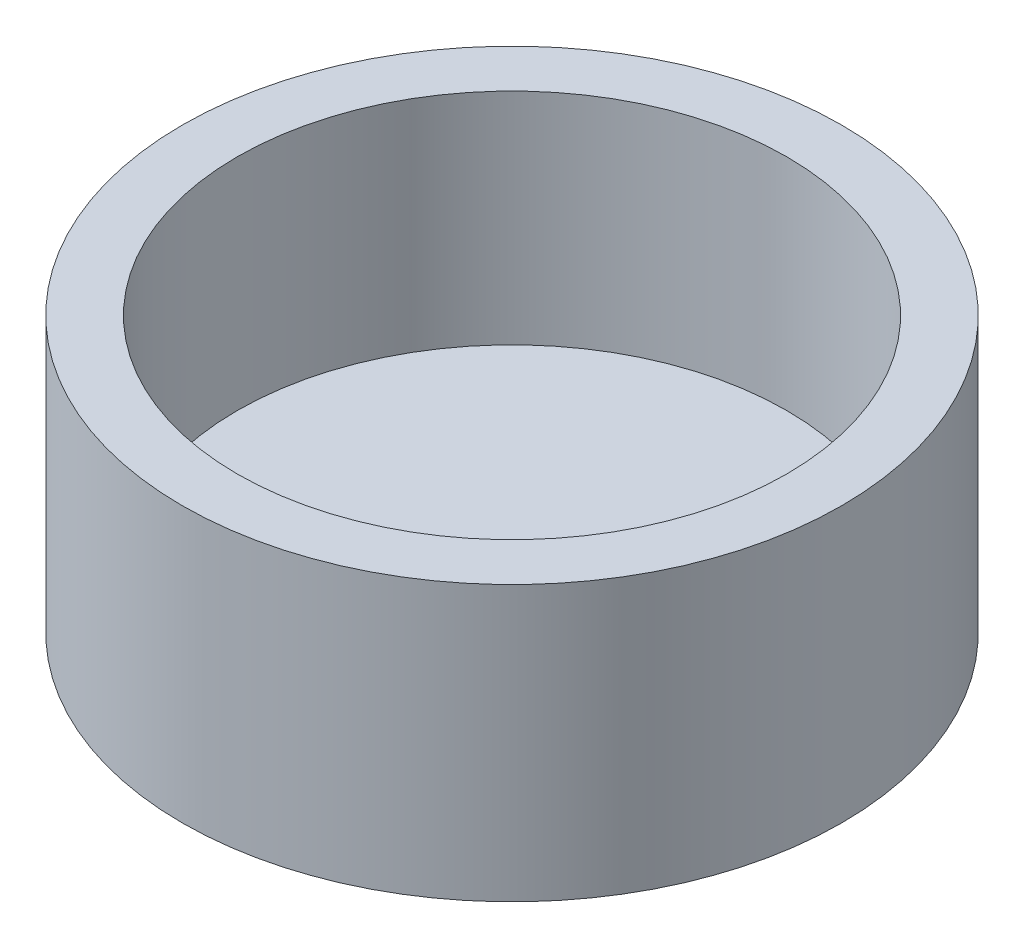
ISO-10303-21;
HEADER;
FILE_DESCRIPTION(('STEP AP214'),'2;1');
FILE_NAME('part.step','',(''),(''),'','','');
FILE_SCHEMA(('AUTOMOTIVE_DESIGN { 1 0 10303 214 1 1 1 1 }'));
ENDSEC;
DATA;
#1=APPLICATION_CONTEXT('core data for automotive mechanical design processes');
#2=APPLICATION_PROTOCOL_DEFINITION('international standard','automotive_design',2000,#1);
#3=PRODUCT_CONTEXT('',#1,'mechanical');
#4=PRODUCT('Part','Part','',(#3));
#5=PRODUCT_RELATED_PRODUCT_CATEGORY('part','',(#4));
#6=PRODUCT_DEFINITION_FORMATION('','',#4);
#7=PRODUCT_DEFINITION_CONTEXT('part definition',#1,'design');
#8=PRODUCT_DEFINITION('design','',#6,#7);
#9=PRODUCT_DEFINITION_SHAPE('','',#8);
#10=(LENGTH_UNIT() NAMED_UNIT(*) SI_UNIT(.MILLI.,.METRE.));
#11=(NAMED_UNIT(*) PLANE_ANGLE_UNIT() SI_UNIT($,.RADIAN.));
#12=(NAMED_UNIT(*) SI_UNIT($,.STERADIAN.) SOLID_ANGLE_UNIT());
#13=UNCERTAINTY_MEASURE_WITH_UNIT(LENGTH_MEASURE(1.E-05),#10,'distance_accuracy_value','');
#14=(GEOMETRIC_REPRESENTATION_CONTEXT(3) GLOBAL_UNCERTAINTY_ASSIGNED_CONTEXT((#13)) GLOBAL_UNIT_ASSIGNED_CONTEXT((#10,
#11,#12)) REPRESENTATION_CONTEXT('',''));
#15=CARTESIAN_POINT('',(0.,0.,0.));
#16=DIRECTION('',(0.,0.,1.));
#17=DIRECTION('',(1.,0.,0.));
#18=AXIS2_PLACEMENT_3D('',#15,#16,#17);
#19=CARTESIAN_POINT('',(-5.42511568942762,12.5,-4.3107043035555));
#20=DIRECTION('',(0.,-1.,0.));
#21=DIRECTION('',(0.,0.,-1.));
#22=AXIS2_PLACEMENT_3D('',#19,#20,#21);
#23=CYLINDRICAL_SURFACE('',#22,15.);
#24=CARTESIAN_POINT('',(-5.42511568942762,12.5,-4.3107043035555));
#25=DIRECTION('',(0.,1.,0.));
#26=DIRECTION('',(0.,0.,1.));
#27=AXIS2_PLACEMENT_3D('',#24,#25,#26);
#28=CIRCLE('',#27,15.);
#29=CARTESIAN_POINT('',(-5.42511568942762,12.5,10.6892956964445));
#30=VERTEX_POINT('',#29);
#31=EDGE_CURVE('E10',#30,#30,#28,.T.);
#32=ORIENTED_EDGE('',*,*,#31,.F.);
#33=EDGE_LOOP('',(#32));
#34=FACE_BOUND('',#33,.T.);
#35=CARTESIAN_POINT('',(-5.42511568942762,0.,-4.3107043035555));
#36=DIRECTION('',(0.,1.,0.));
#37=DIRECTION('',(0.,0.,1.));
#38=AXIS2_PLACEMENT_3D('',#35,#36,#37);
#39=CIRCLE('',#38,15.);
#40=CARTESIAN_POINT('',(-5.42511568942762,0.,10.6892956964445));
#41=VERTEX_POINT('',#40);
#42=EDGE_CURVE('E40',#41,#41,#39,.T.);
#43=ORIENTED_EDGE('',*,*,#42,.T.);
#44=EDGE_LOOP('',(#43));
#45=FACE_BOUND('',#44,.T.);
#46=ADVANCED_FACE('F37',(#34,#45),#23,.T.);
#47=CARTESIAN_POINT('',(-5.42511568942762,12.5,-4.3107043035555));
#48=DIRECTION('',(0.,1.,0.));
#49=DIRECTION('',(0.,0.,1.));
#50=AXIS2_PLACEMENT_3D('',#47,#48,#49);
#51=PLANE('',#50);
#52=CARTESIAN_POINT('',(-5.42511568942762,12.5,-4.3107043035555));
#53=DIRECTION('',(0.,1.,0.));
#54=DIRECTION('',(0.,0.,1.));
#55=AXIS2_PLACEMENT_3D('',#52,#53,#54);
#56=CIRCLE('',#55,12.5);
#57=CARTESIAN_POINT('',(-5.42511568942762,12.5,8.1892956964445));
#58=VERTEX_POINT('',#57);
#59=EDGE_CURVE('E51',#58,#58,#56,.T.);
#60=ORIENTED_EDGE('',*,*,#59,.F.);
#61=EDGE_LOOP('',(#60));
#62=FACE_BOUND('',#61,.T.);
#63=ORIENTED_EDGE('',*,*,#31,.T.);
#64=EDGE_LOOP('',(#63));
#65=FACE_BOUND('',#64,.T.);
#66=ADVANCED_FACE('F68',(#62,#65),#51,.T.);
#67=CARTESIAN_POINT('',(-5.42511568942762,0.,-4.3107043035555));
#68=DIRECTION('',(0.,1.,0.));
#69=DIRECTION('',(0.,0.,1.));
#70=AXIS2_PLACEMENT_3D('',#67,#68,#69);
#71=PLANE('',#70);
#72=ORIENTED_EDGE('',*,*,#42,.F.);
#73=EDGE_LOOP('',(#72));
#74=FACE_BOUND('',#73,.T.);
#75=ADVANCED_FACE('F64',(#74),#71,.F.);
#76=CARTESIAN_POINT('',(-5.42511568942762,2.5,-4.3107043035555));
#77=DIRECTION('',(0.,1.,0.));
#78=DIRECTION('',(0.,0.,1.));
#79=AXIS2_PLACEMENT_3D('',#76,#77,#78);
#80=CYLINDRICAL_SURFACE('',#79,12.5);
#81=CARTESIAN_POINT('',(-5.42511568942762,2.5,-4.3107043035555));
#82=DIRECTION('',(0.,1.,0.));
#83=DIRECTION('',(0.,0.,1.));
#84=AXIS2_PLACEMENT_3D('',#81,#82,#83);
#85=CIRCLE('',#84,12.5);
#86=CARTESIAN_POINT('',(-5.42511568942762,2.5,8.1892956964445));
#87=VERTEX_POINT('',#86);
#88=EDGE_CURVE('E49',#87,#87,#85,.T.);
#89=ORIENTED_EDGE('',*,*,#88,.F.);
#90=EDGE_LOOP('',(#89));
#91=FACE_BOUND('',#90,.T.);
#92=ORIENTED_EDGE('',*,*,#59,.T.);
#93=EDGE_LOOP('',(#92));
#94=FACE_BOUND('',#93,.T.);
#95=ADVANCED_FACE('F61',(#91,#94),#80,.F.);
#96=CARTESIAN_POINT('',(-5.42511568942762,2.5,-4.3107043035555));
#97=DIRECTION('',(0.,1.,0.));
#98=DIRECTION('',(0.,0.,1.));
#99=AXIS2_PLACEMENT_3D('',#96,#97,#98);
#100=PLANE('',#99);
#101=ORIENTED_EDGE('',*,*,#88,.T.);
#102=EDGE_LOOP('',(#101));
#103=FACE_BOUND('',#102,.T.);
#104=ADVANCED_FACE('F59',(#103),#100,.T.);
#105=CLOSED_SHELL('',(#46,#66,#75,#95,#104));
#106=MANIFOLD_SOLID_BREP('B2',#105);
#107=ADVANCED_BREP_SHAPE_REPRESENTATION('',(#18,#106),#14);
#108=SHAPE_DEFINITION_REPRESENTATION(#9,#107);
ENDSEC;
END-ISO-10303-21;
